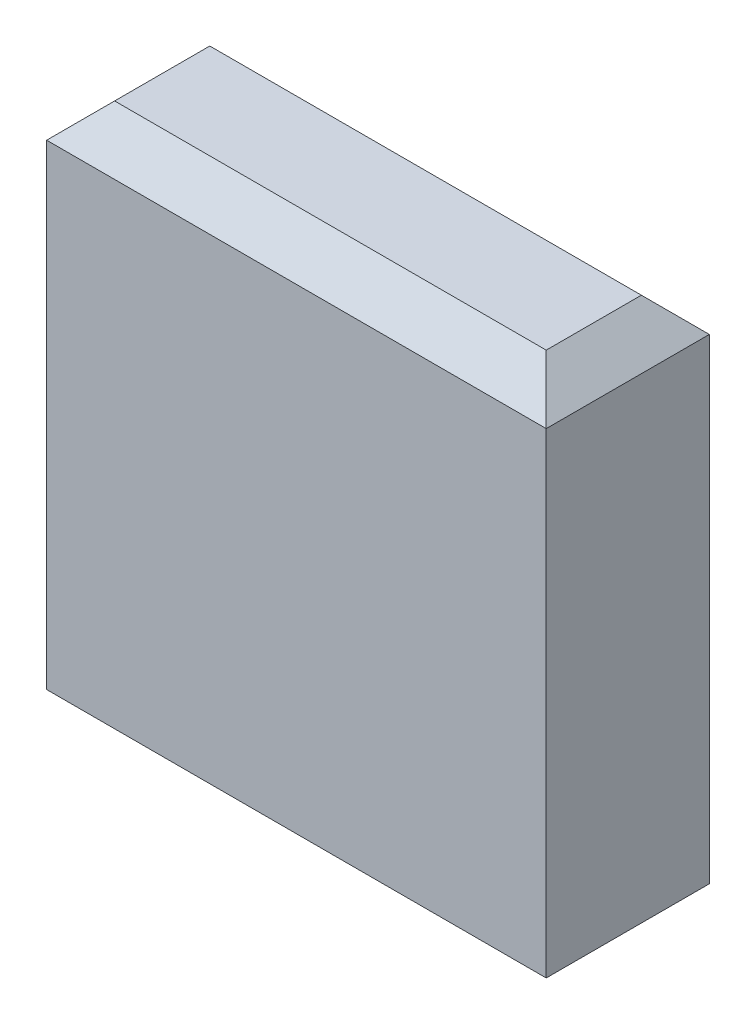
ISO-10303-21;
HEADER;
FILE_DESCRIPTION(('STEP AP214'),'2;1');
FILE_NAME('part.step','',(''),(''),'','','');
FILE_SCHEMA(('AUTOMOTIVE_DESIGN { 1 0 10303 214 1 1 1 1 }'));
ENDSEC;
DATA;
#1=APPLICATION_CONTEXT('core data for automotive mechanical design processes');
#2=APPLICATION_PROTOCOL_DEFINITION('international standard','automotive_design',2000,#1);
#3=PRODUCT_CONTEXT('',#1,'mechanical');
#4=PRODUCT('Part','Part','',(#3));
#5=PRODUCT_RELATED_PRODUCT_CATEGORY('part','',(#4));
#6=PRODUCT_DEFINITION_FORMATION('','',#4);
#7=PRODUCT_DEFINITION_CONTEXT('part definition',#1,'design');
#8=PRODUCT_DEFINITION('design','',#6,#7);
#9=PRODUCT_DEFINITION_SHAPE('','',#8);
#10=(LENGTH_UNIT() NAMED_UNIT(*) SI_UNIT(.MILLI.,.METRE.));
#11=(NAMED_UNIT(*) PLANE_ANGLE_UNIT() SI_UNIT($,.RADIAN.));
#12=(NAMED_UNIT(*) SI_UNIT($,.STERADIAN.) SOLID_ANGLE_UNIT());
#13=UNCERTAINTY_MEASURE_WITH_UNIT(LENGTH_MEASURE(1.E-05),#10,'distance_accuracy_value','');
#14=(GEOMETRIC_REPRESENTATION_CONTEXT(3) GLOBAL_UNCERTAINTY_ASSIGNED_CONTEXT((#13)) GLOBAL_UNIT_ASSIGNED_CONTEXT((#10,
#11,#12)) REPRESENTATION_CONTEXT('',''));
#15=CARTESIAN_POINT('',(0.,0.,0.));
#16=DIRECTION('',(0.,0.,1.));
#17=DIRECTION('',(1.,0.,0.));
#18=AXIS2_PLACEMENT_3D('',#15,#16,#17);
#19=CARTESIAN_POINT('',(-7.35,15.,-2.4));
#20=DIRECTION('',(1.,0.,0.));
#21=DIRECTION('',(0.,0.,-1.));
#22=AXIS2_PLACEMENT_3D('',#19,#20,#21);
#23=PLANE('',#22);
#24=DIRECTION('',(0.,-1.,0.));
#25=VECTOR('',#24,1.);
#26=CARTESIAN_POINT('',(-7.35,15.,2.4));
#27=LINE('',#26,#25);
#28=CARTESIAN_POINT('',(-7.35,14.,2.4));
#29=VERTEX_POINT('',#28);
#30=CARTESIAN_POINT('',(-7.35,0.,2.4));
#31=VERTEX_POINT('',#30);
#32=EDGE_CURVE('E102',#29,#31,#27,.T.);
#33=ORIENTED_EDGE('',*,*,#32,.F.);
#34=DIRECTION('',(0.,0.,-1.));
#35=VECTOR('',#34,1.);
#36=CARTESIAN_POINT('',(-7.35,14.,-2.4));
#37=LINE('',#36,#35);
#38=CARTESIAN_POINT('',(-7.35,14.,-2.4));
#39=VERTEX_POINT('',#38);
#40=EDGE_CURVE('E11',#29,#39,#37,.T.);
#41=ORIENTED_EDGE('',*,*,#40,.T.);
#42=DIRECTION('',(0.,-1.,0.));
#43=VECTOR('',#42,1.);
#44=CARTESIAN_POINT('',(-7.35,15.,-2.4));
#45=LINE('',#44,#43);
#46=CARTESIAN_POINT('',(-7.35,0.,-2.4));
#47=VERTEX_POINT('',#46);
#48=EDGE_CURVE('E124',#39,#47,#45,.T.);
#49=ORIENTED_EDGE('',*,*,#48,.T.);
#50=DIRECTION('',(0.,0.,1.));
#51=VECTOR('',#50,1.);
#52=CARTESIAN_POINT('',(-7.35,0.,-2.4));
#53=LINE('',#52,#51);
#54=EDGE_CURVE('E118',#47,#31,#53,.T.);
#55=ORIENTED_EDGE('',*,*,#54,.T.);
#56=EDGE_LOOP('',(#33,#41,#49,#55));
#57=FACE_BOUND('',#56,.T.);
#58=ADVANCED_FACE('F46',(#57),#23,.F.);
#59=CARTESIAN_POINT('',(7.35,15.,2.4));
#60=DIRECTION('',(0.,0.,-1.));
#61=DIRECTION('',(-1.,0.,0.));
#62=AXIS2_PLACEMENT_3D('',#59,#60,#61);
#63=PLANE('',#62);
#64=DIRECTION('',(0.,-1.,0.));
#65=VECTOR('',#64,1.);
#66=CARTESIAN_POINT('',(7.35,15.,2.4));
#67=LINE('',#66,#65);
#68=CARTESIAN_POINT('',(7.35,14.,2.4));
#69=VERTEX_POINT('',#68);
#70=CARTESIAN_POINT('',(7.35,0.,2.4));
#71=VERTEX_POINT('',#70);
#72=EDGE_CURVE('E112',#69,#71,#67,.T.);
#73=ORIENTED_EDGE('',*,*,#72,.F.);
#74=DIRECTION('',(-1.,0.,0.));
#75=VECTOR('',#74,1.);
#76=CARTESIAN_POINT('',(7.35,14.,2.4));
#77=LINE('',#76,#75);
#78=EDGE_CURVE('E57',#69,#29,#77,.T.);
#79=ORIENTED_EDGE('',*,*,#78,.T.);
#80=ORIENTED_EDGE('',*,*,#32,.T.);
#81=DIRECTION('',(1.,0.,0.));
#82=VECTOR('',#81,1.);
#83=CARTESIAN_POINT('',(7.35,0.,2.4));
#84=LINE('',#83,#82);
#85=EDGE_CURVE('E105',#31,#71,#84,.T.);
#86=ORIENTED_EDGE('',*,*,#85,.T.);
#87=EDGE_LOOP('',(#73,#79,#80,#86));
#88=FACE_BOUND('',#87,.T.);
#89=ADVANCED_FACE('F104',(#88),#63,.F.);
#90=CARTESIAN_POINT('',(7.35,15.,-2.4));
#91=DIRECTION('',(-1.,0.,0.));
#92=DIRECTION('',(0.,0.,1.));
#93=AXIS2_PLACEMENT_3D('',#90,#91,#92);
#94=PLANE('',#93);
#95=DIRECTION('',(0.,-1.,0.));
#96=VECTOR('',#95,1.);
#97=CARTESIAN_POINT('',(7.35,15.,-2.4));
#98=LINE('',#97,#96);
#99=CARTESIAN_POINT('',(7.35,14.,-2.4));
#100=VERTEX_POINT('',#99);
#101=CARTESIAN_POINT('',(7.35,0.,-2.4));
#102=VERTEX_POINT('',#101);
#103=EDGE_CURVE('E139',#100,#102,#98,.T.);
#104=ORIENTED_EDGE('',*,*,#103,.F.);
#105=DIRECTION('',(0.,0.,1.));
#106=VECTOR('',#105,1.);
#107=CARTESIAN_POINT('',(7.35,14.,-2.4));
#108=LINE('',#107,#106);
#109=EDGE_CURVE('E72',#100,#69,#108,.T.);
#110=ORIENTED_EDGE('',*,*,#109,.T.);
#111=ORIENTED_EDGE('',*,*,#72,.T.);
#112=DIRECTION('',(0.,0.,-1.));
#113=VECTOR('',#112,1.);
#114=CARTESIAN_POINT('',(7.35,0.,-2.4));
#115=LINE('',#114,#113);
#116=EDGE_CURVE('E120',#71,#102,#115,.T.);
#117=ORIENTED_EDGE('',*,*,#116,.T.);
#118=EDGE_LOOP('',(#104,#110,#111,#117));
#119=FACE_BOUND('',#118,.T.);
#120=ADVANCED_FACE('F189',(#119),#94,.F.);
#121=CARTESIAN_POINT('',(7.35,15.,-2.4));
#122=DIRECTION('',(0.,0.,1.));
#123=DIRECTION('',(1.,0.,0.));
#124=AXIS2_PLACEMENT_3D('',#121,#122,#123);
#125=PLANE('',#124);
#126=ORIENTED_EDGE('',*,*,#48,.F.);
#127=DIRECTION('',(1.,0.,0.));
#128=VECTOR('',#127,1.);
#129=CARTESIAN_POINT('',(7.35,14.,-2.4));
#130=LINE('',#129,#128);
#131=EDGE_CURVE('E156',#39,#100,#130,.T.);
#132=ORIENTED_EDGE('',*,*,#131,.T.);
#133=ORIENTED_EDGE('',*,*,#103,.T.);
#134=DIRECTION('',(-1.,0.,0.));
#135=VECTOR('',#134,1.);
#136=CARTESIAN_POINT('',(7.35,0.,-2.4));
#137=LINE('',#136,#135);
#138=EDGE_CURVE('E134',#102,#47,#137,.T.);
#139=ORIENTED_EDGE('',*,*,#138,.T.);
#140=EDGE_LOOP('',(#126,#132,#133,#139));
#141=FACE_BOUND('',#140,.T.);
#142=ADVANCED_FACE('F188',(#141),#125,.F.);
#143=CARTESIAN_POINT('',(0.,15.,0.));
#144=DIRECTION('',(0.,-1.,0.));
#145=DIRECTION('',(0.,0.,-1.));
#146=AXIS2_PLACEMENT_3D('',#143,#144,#145);
#147=PLANE('',#146);
#148=DIRECTION('',(0.,0.,-1.));
#149=VECTOR('',#148,1.);
#150=CARTESIAN_POINT('',(6.35,15.,0.));
#151=LINE('',#150,#149);
#152=CARTESIAN_POINT('',(6.35,15.,1.4));
#153=VERTEX_POINT('',#152);
#154=CARTESIAN_POINT('',(6.35,15.,-1.4));
#155=VERTEX_POINT('',#154);
#156=EDGE_CURVE('E149',#153,#155,#151,.T.);
#157=ORIENTED_EDGE('',*,*,#156,.T.);
#158=DIRECTION('',(-1.,0.,0.));
#159=VECTOR('',#158,1.);
#160=CARTESIAN_POINT('',(0.,15.,-1.4));
#161=LINE('',#160,#159);
#162=CARTESIAN_POINT('',(-6.35,15.,-1.4));
#163=VERTEX_POINT('',#162);
#164=EDGE_CURVE('E152',#155,#163,#161,.T.);
#165=ORIENTED_EDGE('',*,*,#164,.T.);
#166=DIRECTION('',(0.,0.,1.));
#167=VECTOR('',#166,1.);
#168=CARTESIAN_POINT('',(-6.35,15.,0.));
#169=LINE('',#168,#167);
#170=CARTESIAN_POINT('',(-6.35,15.,1.4));
#171=VERTEX_POINT('',#170);
#172=EDGE_CURVE('E111',#163,#171,#169,.T.);
#173=ORIENTED_EDGE('',*,*,#172,.T.);
#174=DIRECTION('',(1.,0.,0.));
#175=VECTOR('',#174,1.);
#176=CARTESIAN_POINT('',(0.,15.,1.4));
#177=LINE('',#176,#175);
#178=EDGE_CURVE('E146',#171,#153,#177,.T.);
#179=ORIENTED_EDGE('',*,*,#178,.T.);
#180=EDGE_LOOP('',(#157,#165,#173,#179));
#181=FACE_BOUND('',#180,.T.);
#182=ADVANCED_FACE('F181',(#181),#147,.F.);
#183=CARTESIAN_POINT('',(0.,0.,0.));
#184=DIRECTION('',(0.,-1.,0.));
#185=DIRECTION('',(0.,0.,-1.));
#186=AXIS2_PLACEMENT_3D('',#183,#184,#185);
#187=PLANE('',#186);
#188=ORIENTED_EDGE('',*,*,#54,.F.);
#189=ORIENTED_EDGE('',*,*,#138,.F.);
#190=ORIENTED_EDGE('',*,*,#116,.F.);
#191=ORIENTED_EDGE('',*,*,#85,.F.);
#192=EDGE_LOOP('',(#188,#189,#190,#191));
#193=FACE_BOUND('',#192,.T.);
#194=ADVANCED_FACE('F116',(#193),#187,.T.);
#195=CARTESIAN_POINT('',(0.,15.,1.4));
#196=DIRECTION('',(0.,-0.707106781186546,-0.707106781186549));
#197=DIRECTION('',(1.,0.,0.));
#198=AXIS2_PLACEMENT_3D('',#195,#196,#197);
#199=PLANE('',#198);
#200=DIRECTION('',(0.577350269189625,0.577350269189627,-0.577350269189625));
#201=VECTOR('',#200,1.);
#202=CARTESIAN_POINT('',(-5.88333333333334,15.4666666666667,0.933333333333335));
#203=LINE('',#202,#201);
#204=EDGE_CURVE('E130',#29,#171,#203,.T.);
#205=ORIENTED_EDGE('',*,*,#204,.F.);
#206=ORIENTED_EDGE('',*,*,#78,.F.);
#207=DIRECTION('',(-0.577350269189625,0.577350269189627,-0.577350269189625));
#208=VECTOR('',#207,1.);
#209=CARTESIAN_POINT('',(4.23333333333334,17.1166666666667,-0.716666666666663));
#210=LINE('',#209,#208);
#211=EDGE_CURVE('E51',#153,#69,#210,.F.);
#212=ORIENTED_EDGE('',*,*,#211,.F.);
#213=ORIENTED_EDGE('',*,*,#178,.F.);
#214=EDGE_LOOP('',(#205,#206,#212,#213));
#215=FACE_BOUND('',#214,.T.);
#216=ADVANCED_FACE('F49',(#215),#199,.F.);
#217=CARTESIAN_POINT('',(6.35,15.,0.));
#218=DIRECTION('',(-0.707106781186549,-0.707106781186546,0.));
#219=DIRECTION('',(0.,0.,-1.));
#220=AXIS2_PLACEMENT_3D('',#217,#218,#219);
#221=PLANE('',#220);
#222=ORIENTED_EDGE('',*,*,#211,.T.);
#223=ORIENTED_EDGE('',*,*,#109,.F.);
#224=DIRECTION('',(-0.577350269189625,0.577350269189627,0.577350269189625));
#225=VECTOR('',#224,1.);
#226=CARTESIAN_POINT('',(5.88333333333333,15.4666666666667,-0.933333333333334));
#227=LINE('',#226,#225);
#228=EDGE_CURVE('E167',#155,#100,#227,.F.);
#229=ORIENTED_EDGE('',*,*,#228,.F.);
#230=ORIENTED_EDGE('',*,*,#156,.F.);
#231=EDGE_LOOP('',(#222,#223,#229,#230));
#232=FACE_BOUND('',#231,.T.);
#233=ADVANCED_FACE('F216',(#232),#221,.F.);
#234=CARTESIAN_POINT('',(-6.35,15.,0.));
#235=DIRECTION('',(0.707106781186549,-0.707106781186546,0.));
#236=DIRECTION('',(0.,0.,1.));
#237=AXIS2_PLACEMENT_3D('',#234,#235,#236);
#238=PLANE('',#237);
#239=ORIENTED_EDGE('',*,*,#204,.T.);
#240=ORIENTED_EDGE('',*,*,#172,.F.);
#241=DIRECTION('',(-0.577350269189625,-0.577350269189627,-0.577350269189625));
#242=VECTOR('',#241,1.);
#243=CARTESIAN_POINT('',(-5.88333333333334,15.4666666666667,-0.933333333333332));
#244=LINE('',#243,#242);
#245=EDGE_CURVE('E164',#39,#163,#244,.F.);
#246=ORIENTED_EDGE('',*,*,#245,.F.);
#247=ORIENTED_EDGE('',*,*,#40,.F.);
#248=EDGE_LOOP('',(#239,#240,#246,#247));
#249=FACE_BOUND('',#248,.T.);
#250=ADVANCED_FACE('F174',(#249),#238,.F.);
#251=CARTESIAN_POINT('',(0.,15.,-1.4));
#252=DIRECTION('',(0.,-0.707106781186546,0.707106781186549));
#253=DIRECTION('',(-1.,0.,0.));
#254=AXIS2_PLACEMENT_3D('',#251,#252,#253);
#255=PLANE('',#254);
#256=ORIENTED_EDGE('',*,*,#228,.T.);
#257=ORIENTED_EDGE('',*,*,#131,.F.);
#258=ORIENTED_EDGE('',*,*,#245,.T.);
#259=ORIENTED_EDGE('',*,*,#164,.F.);
#260=EDGE_LOOP('',(#256,#257,#258,#259));
#261=FACE_BOUND('',#260,.T.);
#262=ADVANCED_FACE('F185',(#261),#255,.F.);
#263=CLOSED_SHELL('',(#58,#89,#120,#142,#182,#194,#216,#233,#250,#262));
#264=MANIFOLD_SOLID_BREP('B2',#263);
#265=ADVANCED_BREP_SHAPE_REPRESENTATION('',(#18,#264),#14);
#266=SHAPE_DEFINITION_REPRESENTATION(#9,#265);
ENDSEC;
END-ISO-10303-21;
